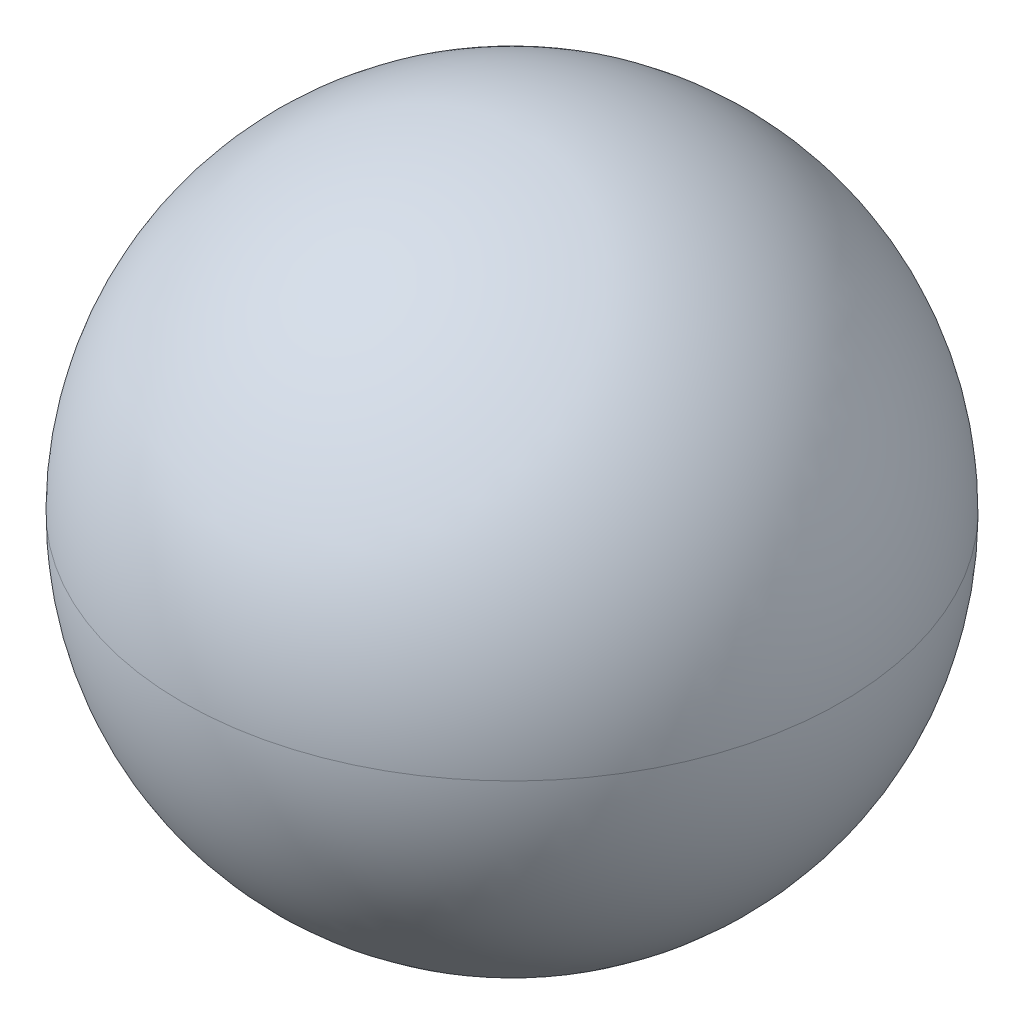
ISO-10303-21;
HEADER;
FILE_DESCRIPTION(('STEP AP214'),'2;1');
FILE_NAME('part.step','',(''),(''),'','','');
FILE_SCHEMA(('AUTOMOTIVE_DESIGN { 1 0 10303 214 1 1 1 1 }'));
ENDSEC;
DATA;
#1=APPLICATION_CONTEXT('core data for automotive mechanical design processes');
#2=APPLICATION_PROTOCOL_DEFINITION('international standard','automotive_design',2000,#1);
#3=PRODUCT_CONTEXT('',#1,'mechanical');
#4=PRODUCT('Part','Part','',(#3));
#5=PRODUCT_RELATED_PRODUCT_CATEGORY('part','',(#4));
#6=PRODUCT_DEFINITION_FORMATION('','',#4);
#7=PRODUCT_DEFINITION_CONTEXT('part definition',#1,'design');
#8=PRODUCT_DEFINITION('design','',#6,#7);
#9=PRODUCT_DEFINITION_SHAPE('','',#8);
#10=(LENGTH_UNIT() NAMED_UNIT(*) SI_UNIT(.MILLI.,.METRE.));
#11=(NAMED_UNIT(*) PLANE_ANGLE_UNIT() SI_UNIT($,.RADIAN.));
#12=(NAMED_UNIT(*) SI_UNIT($,.STERADIAN.) SOLID_ANGLE_UNIT());
#13=UNCERTAINTY_MEASURE_WITH_UNIT(LENGTH_MEASURE(1.E-05),#10,'distance_accuracy_value','');
#14=(GEOMETRIC_REPRESENTATION_CONTEXT(3) GLOBAL_UNCERTAINTY_ASSIGNED_CONTEXT((#13)) GLOBAL_UNIT_ASSIGNED_CONTEXT((#10,
#11,#12)) REPRESENTATION_CONTEXT('',''));
#15=CARTESIAN_POINT('',(0.,0.,0.));
#16=DIRECTION('',(0.,0.,1.));
#17=DIRECTION('',(1.,0.,0.));
#18=AXIS2_PLACEMENT_3D('',#15,#16,#17);
#19=CARTESIAN_POINT('',(0.,11.7,0.));
#20=DIRECTION('',(0.,1.,0.));
#21=DIRECTION('',(0.,0.,1.));
#22=AXIS2_PLACEMENT_3D('',#19,#20,#21);
#23=SPHERICAL_SURFACE('',#22,11.7);
#24=CARTESIAN_POINT('',(0.,11.7,0.));
#25=DIRECTION('',(0.,-1.,0.));
#26=DIRECTION('',(0.,0.,-1.));
#27=AXIS2_PLACEMENT_3D('',#24,#25,#26);
#28=CIRCLE('',#27,11.7);
#29=CARTESIAN_POINT('',(0.,11.7,-11.7));
#30=VERTEX_POINT('',#29);
#31=EDGE_CURVE('E10',#30,#30,#28,.T.);
#32=ORIENTED_EDGE('',*,*,#31,.T.);
#33=EDGE_LOOP('',(#32));
#34=FACE_BOUND('',#33,.T.);
#35=CARTESIAN_POINT('',(0.,0.391153905017542,0.));
#36=DIRECTION('',(0.,1.,0.));
#37=DIRECTION('',(0.,0.,1.));
#38=AXIS2_PLACEMENT_3D('',#35,#36,#37);
#39=CIRCLE('',#38,3.);
#40=CARTESIAN_POINT('',(0.,0.391153905017542,3.));
#41=VERTEX_POINT('',#40);
#42=EDGE_CURVE('E47',#41,#41,#39,.T.);
#43=ORIENTED_EDGE('',*,*,#42,.T.);
#44=EDGE_LOOP('',(#43));
#45=FACE_BOUND('',#44,.T.);
#46=ADVANCED_FACE('F43',(#34,#45),#23,.T.);
#47=CARTESIAN_POINT('',(0.,11.7,0.));
#48=DIRECTION('',(0.,1.,0.));
#49=DIRECTION('',(0.,0.,1.));
#50=AXIS2_PLACEMENT_3D('',#47,#48,#49);
#51=SPHERICAL_SURFACE('',#50,11.7);
#52=ORIENTED_EDGE('',*,*,#31,.F.);
#53=EDGE_LOOP('',(#52));
#54=FACE_BOUND('',#53,.T.);
#55=ADVANCED_FACE('F45',(#54),#51,.T.);
#56=CARTESIAN_POINT('',(0.,8.,0.));
#57=DIRECTION('',(0.,-1.,0.));
#58=DIRECTION('',(0.,0.,-1.));
#59=AXIS2_PLACEMENT_3D('',#56,#57,#58);
#60=CYLINDRICAL_SURFACE('',#59,3.);
#61=ORIENTED_EDGE('',*,*,#42,.F.);
#62=EDGE_LOOP('',(#61));
#63=FACE_BOUND('',#62,.T.);
#64=CARTESIAN_POINT('',(0.,8.,0.));
#65=DIRECTION('',(0.,1.,0.));
#66=DIRECTION('',(0.,0.,1.));
#67=AXIS2_PLACEMENT_3D('',#64,#65,#66);
#68=CIRCLE('',#67,3.);
#69=CARTESIAN_POINT('',(0.,8.,3.));
#70=VERTEX_POINT('',#69);
#71=EDGE_CURVE('E56',#70,#70,#68,.T.);
#72=ORIENTED_EDGE('',*,*,#71,.T.);
#73=EDGE_LOOP('',(#72));
#74=FACE_BOUND('',#73,.T.);
#75=ADVANCED_FACE('F62',(#63,#74),#60,.F.);
#76=CARTESIAN_POINT('',(0.,8.,0.));
#77=DIRECTION('',(0.,1.,0.));
#78=DIRECTION('',(0.,0.,1.));
#79=AXIS2_PLACEMENT_3D('',#76,#77,#78);
#80=PLANE('',#79);
#81=ORIENTED_EDGE('',*,*,#71,.F.);
#82=EDGE_LOOP('',(#81));
#83=FACE_BOUND('',#82,.T.);
#84=ADVANCED_FACE('F64',(#83),#80,.F.);
#85=CLOSED_SHELL('',(#46,#55,#75,#84));
#86=MANIFOLD_SOLID_BREP('B2',#85);
#87=ADVANCED_BREP_SHAPE_REPRESENTATION('',(#18,#86),#14);
#88=SHAPE_DEFINITION_REPRESENTATION(#9,#87);
ENDSEC;
END-ISO-10303-21;
